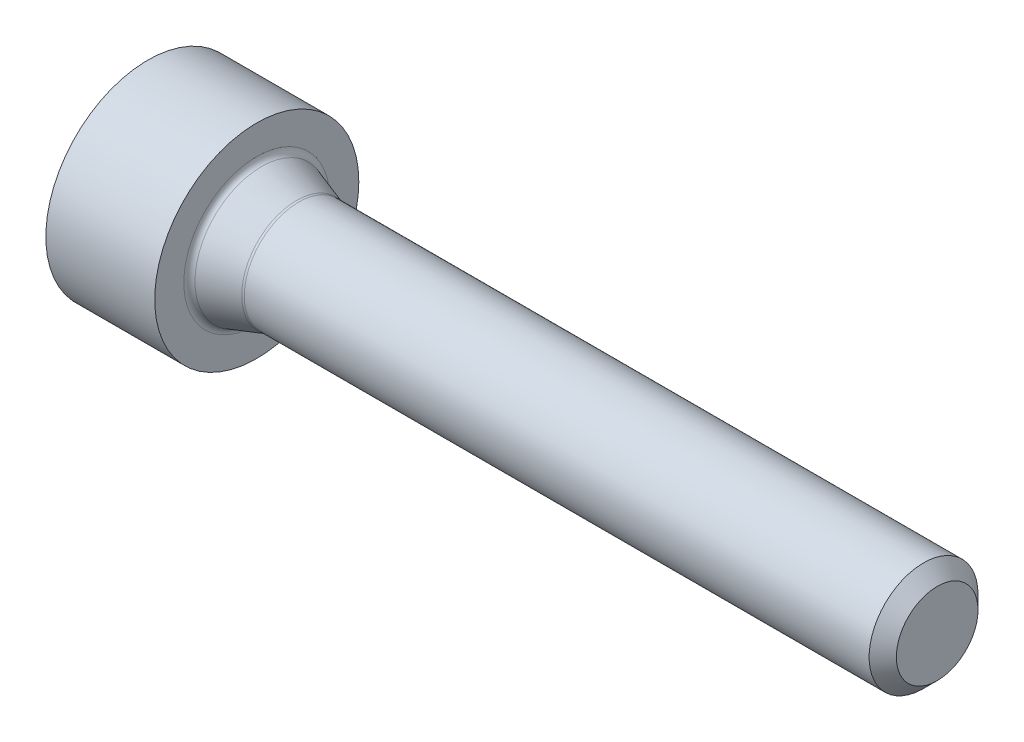
ISO-10303-21;
HEADER;
FILE_DESCRIPTION(('STEP AP214'),'2;1');
FILE_NAME('part.step','',(''),(''),'','','');
FILE_SCHEMA(('AUTOMOTIVE_DESIGN { 1 0 10303 214 1 1 1 1 }'));
ENDSEC;
DATA;
#1=APPLICATION_CONTEXT('core data for automotive mechanical design processes');
#2=APPLICATION_PROTOCOL_DEFINITION('international standard','automotive_design',2000,#1);
#3=PRODUCT_CONTEXT('',#1,'mechanical');
#4=PRODUCT('Part','Part','',(#3));
#5=PRODUCT_RELATED_PRODUCT_CATEGORY('part','',(#4));
#6=PRODUCT_DEFINITION_FORMATION('','',#4);
#7=PRODUCT_DEFINITION_CONTEXT('part definition',#1,'design');
#8=PRODUCT_DEFINITION('design','',#6,#7);
#9=PRODUCT_DEFINITION_SHAPE('','',#8);
#10=(LENGTH_UNIT() NAMED_UNIT(*) SI_UNIT(.MILLI.,.METRE.));
#11=(NAMED_UNIT(*) PLANE_ANGLE_UNIT() SI_UNIT($,.RADIAN.));
#12=(NAMED_UNIT(*) SI_UNIT($,.STERADIAN.) SOLID_ANGLE_UNIT());
#13=UNCERTAINTY_MEASURE_WITH_UNIT(LENGTH_MEASURE(1.E-05),#10,'distance_accuracy_value','');
#14=(GEOMETRIC_REPRESENTATION_CONTEXT(3) GLOBAL_UNCERTAINTY_ASSIGNED_CONTEXT((#13)) GLOBAL_UNIT_ASSIGNED_CONTEXT((#10,
#11,#12)) REPRESENTATION_CONTEXT('',''));
#15=CARTESIAN_POINT('',(0.,0.,0.));
#16=DIRECTION('',(0.,0.,1.));
#17=DIRECTION('',(1.,0.,0.));
#18=AXIS2_PLACEMENT_3D('',#15,#16,#17);
#19=CARTESIAN_POINT('',(0.,0.,0.));
#20=DIRECTION('',(-1.,0.,0.));
#21=DIRECTION('',(0.,0.,1.));
#22=AXIS2_PLACEMENT_3D('',#19,#20,#21);
#23=PLANE('',#22);
#24=DIRECTION('',(0.,0.5,-0.866025403784439));
#25=VECTOR('',#24,1.);
#26=CARTESIAN_POINT('',(0.,0.43325,0.750411012379216));
#27=LINE('',#26,#25);
#28=CARTESIAN_POINT('',(0.,0.43325,0.750411012379216));
#29=VERTEX_POINT('',#28);
#30=CARTESIAN_POINT('',(0.,0.8665,0.));
#31=VERTEX_POINT('',#30);
#32=EDGE_CURVE('E54',#29,#31,#27,.T.);
#33=ORIENTED_EDGE('',*,*,#32,.F.);
#34=DIRECTION('',(0.,1.,0.));
#35=VECTOR('',#34,1.);
#36=CARTESIAN_POINT('',(0.,-0.43325,0.750411012379216));
#37=LINE('',#36,#35);
#38=CARTESIAN_POINT('',(0.,-0.43325,0.750411012379216));
#39=VERTEX_POINT('',#38);
#40=EDGE_CURVE('E137',#39,#29,#37,.T.);
#41=ORIENTED_EDGE('',*,*,#40,.F.);
#42=DIRECTION('',(0.,0.5,0.866025403784439));
#43=VECTOR('',#42,1.);
#44=CARTESIAN_POINT('',(0.,-0.8665,0.));
#45=LINE('',#44,#43);
#46=CARTESIAN_POINT('',(0.,-0.8665,0.));
#47=VERTEX_POINT('',#46);
#48=EDGE_CURVE('E135',#47,#39,#45,.T.);
#49=ORIENTED_EDGE('',*,*,#48,.F.);
#50=DIRECTION('',(0.,-0.5,0.866025403784439));
#51=VECTOR('',#50,1.);
#52=CARTESIAN_POINT('',(0.,-0.43325,-0.750411012379216));
#53=LINE('',#52,#51);
#54=CARTESIAN_POINT('',(0.,-0.43325,-0.750411012379216));
#55=VERTEX_POINT('',#54);
#56=EDGE_CURVE('E102',#55,#47,#53,.T.);
#57=ORIENTED_EDGE('',*,*,#56,.F.);
#58=DIRECTION('',(0.,-1.,0.));
#59=VECTOR('',#58,1.);
#60=CARTESIAN_POINT('',(0.,0.43325,-0.750411012379216));
#61=LINE('',#60,#59);
#62=CARTESIAN_POINT('',(0.,0.43325,-0.750411012379216));
#63=VERTEX_POINT('',#62);
#64=EDGE_CURVE('E131',#63,#55,#61,.T.);
#65=ORIENTED_EDGE('',*,*,#64,.F.);
#66=DIRECTION('',(0.,-0.5,-0.866025403784439));
#67=VECTOR('',#66,1.);
#68=CARTESIAN_POINT('',(0.,0.8665,0.));
#69=LINE('',#68,#67);
#70=EDGE_CURVE('E128',#31,#63,#69,.T.);
#71=ORIENTED_EDGE('',*,*,#70,.F.);
#72=EDGE_LOOP('',(#33,#41,#49,#57,#65,#71));
#73=FACE_BOUND('',#72,.T.);
#74=CARTESIAN_POINT('',(0.,0.,0.));
#75=DIRECTION('',(1.,0.,0.));
#76=DIRECTION('',(0.,0.,-1.));
#77=AXIS2_PLACEMENT_3D('',#74,#75,#76);
#78=CIRCLE('',#77,1.5);
#79=CARTESIAN_POINT('',(0.,0.,-1.5));
#80=VERTEX_POINT('',#79);
#81=EDGE_CURVE('E149',#80,#80,#78,.T.);
#82=ORIENTED_EDGE('',*,*,#81,.F.);
#83=EDGE_LOOP('',(#82));
#84=FACE_BOUND('',#83,.T.);
#85=ADVANCED_FACE('F39',(#73,#84),#23,.T.);
#86=CARTESIAN_POINT('',(0.,0.,0.));
#87=DIRECTION('',(1.,0.,0.));
#88=DIRECTION('',(0.,0.,-1.));
#89=AXIS2_PLACEMENT_3D('',#86,#87,#88);
#90=CYLINDRICAL_SURFACE('',#89,1.5);
#91=ORIENTED_EDGE('',*,*,#81,.T.);
#92=EDGE_LOOP('',(#91));
#93=FACE_BOUND('',#92,.T.);
#94=CARTESIAN_POINT('',(1.6,0.,0.));
#95=DIRECTION('',(1.,0.,0.));
#96=DIRECTION('',(0.,0.,-1.));
#97=AXIS2_PLACEMENT_3D('',#94,#95,#96);
#98=CIRCLE('',#97,1.5);
#99=CARTESIAN_POINT('',(1.6,0.,-1.5));
#100=VERTEX_POINT('',#99);
#101=EDGE_CURVE('E141',#100,#100,#98,.T.);
#102=ORIENTED_EDGE('',*,*,#101,.F.);
#103=EDGE_LOOP('',(#102));
#104=FACE_BOUND('',#103,.T.);
#105=ADVANCED_FACE('F182',(#93,#104),#90,.T.);
#106=CARTESIAN_POINT('',(1.6,1.5,0.));
#107=DIRECTION('',(1.,0.,0.));
#108=DIRECTION('',(0.,0.,-1.));
#109=AXIS2_PLACEMENT_3D('',#106,#107,#108);
#110=PLANE('',#109);
#111=CARTESIAN_POINT('',(1.6,0.,0.));
#112=DIRECTION('',(1.,0.,0.));
#113=DIRECTION('',(0.,0.,-1.));
#114=AXIS2_PLACEMENT_3D('',#111,#112,#113);
#115=CIRCLE('',#114,1.07207592200561);
#116=CARTESIAN_POINT('',(1.6,0.,-1.07207592200561));
#117=VERTEX_POINT('',#116);
#118=EDGE_CURVE('E161',#117,#117,#115,.F.);
#119=ORIENTED_EDGE('',*,*,#118,.T.);
#120=EDGE_LOOP('',(#119));
#121=FACE_BOUND('',#120,.T.);
#122=ORIENTED_EDGE('',*,*,#101,.T.);
#123=EDGE_LOOP('',(#122));
#124=FACE_BOUND('',#123,.T.);
#125=ADVANCED_FACE('F188',(#121,#124),#110,.T.);
#126=CARTESIAN_POINT('',(2.2,0.,0.));
#127=DIRECTION('',(-1.,0.,0.));
#128=DIRECTION('',(0.,0.,1.));
#129=AXIS2_PLACEMENT_3D('',#126,#127,#128);
#130=CONICAL_SURFACE('',#129,0.800000000000001,0.32175055439664);
#131=CARTESIAN_POINT('',(2.18460498941515,0.,0.));
#132=DIRECTION('',(-1.,0.,0.));
#133=DIRECTION('',(0.,0.,1.));
#134=AXIS2_PLACEMENT_3D('',#131,#132,#133);
#135=CIRCLE('',#134,0.80513167019495);
#136=CARTESIAN_POINT('',(2.18460498941515,0.,0.80513167019495));
#137=VERTEX_POINT('',#136);
#138=EDGE_CURVE('E158',#137,#137,#135,.T.);
#139=ORIENTED_EDGE('',*,*,#138,.T.);
#140=EDGE_LOOP('',(#139));
#141=FACE_BOUND('',#140,.T.);
#142=CARTESIAN_POINT('',(1.66837722339832,0.,0.));
#143=DIRECTION('',(-1.,0.,0.));
#144=DIRECTION('',(0.,0.,1.));
#145=AXIS2_PLACEMENT_3D('',#142,#143,#144);
#146=CIRCLE('',#145,0.977207592200562);
#147=CARTESIAN_POINT('',(1.66837722339832,0.,0.977207592200562));
#148=VERTEX_POINT('',#147);
#149=EDGE_CURVE('E155',#148,#148,#146,.F.);
#150=ORIENTED_EDGE('',*,*,#149,.T.);
#151=EDGE_LOOP('',(#150));
#152=FACE_BOUND('',#151,.T.);
#153=ADVANCED_FACE('F206',(#141,#152),#130,.T.);
#154=CARTESIAN_POINT('',(0.,0.,0.));
#155=DIRECTION('',(1.,0.,0.));
#156=DIRECTION('',(0.,0.,-1.));
#157=AXIS2_PLACEMENT_3D('',#154,#155,#156);
#158=CYLINDRICAL_SURFACE('',#157,0.800000000000001);
#159=CARTESIAN_POINT('',(11.4,0.,0.));
#160=DIRECTION('',(1.,0.,0.));
#161=DIRECTION('',(0.,0.,-1.));
#162=AXIS2_PLACEMENT_3D('',#159,#160,#161);
#163=CIRCLE('',#162,0.800000000000001);
#164=CARTESIAN_POINT('',(11.4,0.,-0.800000000000001));
#165=VERTEX_POINT('',#164);
#166=EDGE_CURVE('E11',#165,#165,#163,.F.);
#167=ORIENTED_EDGE('',*,*,#166,.T.);
#168=EDGE_LOOP('',(#167));
#169=FACE_BOUND('',#168,.T.);
#170=CARTESIAN_POINT('',(2.21622776601684,0.,0.));
#171=DIRECTION('',(1.,0.,0.));
#172=DIRECTION('',(0.,0.,-1.));
#173=AXIS2_PLACEMENT_3D('',#170,#171,#172);
#174=CIRCLE('',#173,0.800000000000001);
#175=CARTESIAN_POINT('',(2.21622776601684,0.,-0.800000000000001));
#176=VERTEX_POINT('',#175);
#177=EDGE_CURVE('E152',#176,#176,#174,.T.);
#178=ORIENTED_EDGE('',*,*,#177,.T.);
#179=EDGE_LOOP('',(#178));
#180=FACE_BOUND('',#179,.T.);
#181=ADVANCED_FACE('F199',(#169,#180),#158,.T.);
#182=CARTESIAN_POINT('',(11.6,0.800000000000001,0.));
#183=DIRECTION('',(1.,0.,0.));
#184=DIRECTION('',(0.,0.,-1.));
#185=AXIS2_PLACEMENT_3D('',#182,#183,#184);
#186=PLANE('',#185);
#187=CARTESIAN_POINT('',(11.6,0.,0.));
#188=DIRECTION('',(1.,0.,0.));
#189=DIRECTION('',(0.,0.,-1.));
#190=AXIS2_PLACEMENT_3D('',#187,#188,#189);
#191=CIRCLE('',#190,0.6);
#192=CARTESIAN_POINT('',(11.6,0.,-0.6));
#193=VERTEX_POINT('',#192);
#194=EDGE_CURVE('E47',#193,#193,#191,.T.);
#195=ORIENTED_EDGE('',*,*,#194,.T.);
#196=EDGE_LOOP('',(#195));
#197=FACE_BOUND('',#196,.T.);
#198=ADVANCED_FACE('F166',(#197),#186,.T.);
#199=CARTESIAN_POINT('',(2.21622776601684,0.,0.));
#200=DIRECTION('',(1.,0.,0.));
#201=DIRECTION('',(0.,0.,-1.));
#202=AXIS2_PLACEMENT_3D('',#199,#200,#201);
#203=TOROIDAL_SURFACE('',#202,0.900000000000001,0.1);
#204=ORIENTED_EDGE('',*,*,#138,.F.);
#205=EDGE_LOOP('',(#204));
#206=FACE_BOUND('',#205,.T.);
#207=ORIENTED_EDGE('',*,*,#177,.F.);
#208=EDGE_LOOP('',(#207));
#209=FACE_BOUND('',#208,.T.);
#210=ADVANCED_FACE('F178',(#206,#209),#203,.F.);
#211=CARTESIAN_POINT('',(1.7,0.,0.));
#212=DIRECTION('',(1.,0.,0.));
#213=DIRECTION('',(0.,0.,-1.));
#214=AXIS2_PLACEMENT_3D('',#211,#212,#213);
#215=TOROIDAL_SURFACE('',#214,1.07207592200561,0.1);
#216=ORIENTED_EDGE('',*,*,#118,.F.);
#217=EDGE_LOOP('',(#216));
#218=FACE_BOUND('',#217,.T.);
#219=ORIENTED_EDGE('',*,*,#149,.F.);
#220=EDGE_LOOP('',(#219));
#221=FACE_BOUND('',#220,.T.);
#222=ADVANCED_FACE('F170',(#218,#221),#215,.F.);
#223=CARTESIAN_POINT('',(11.6,0.,0.));
#224=DIRECTION('',(-1.,0.,0.));
#225=DIRECTION('',(0.,0.,1.));
#226=AXIS2_PLACEMENT_3D('',#223,#224,#225);
#227=CONICAL_SURFACE('',#226,0.6,0.785398163397447);
#228=ORIENTED_EDGE('',*,*,#166,.F.);
#229=EDGE_LOOP('',(#228));
#230=FACE_BOUND('',#229,.T.);
#231=ORIENTED_EDGE('',*,*,#194,.F.);
#232=EDGE_LOOP('',(#231));
#233=FACE_BOUND('',#232,.T.);
#234=ADVANCED_FACE('F41',(#230,#233),#227,.T.);
#235=CARTESIAN_POINT('',(0.7,0.43325,0.750411012379216));
#236=DIRECTION('',(0.,0.866025403784439,0.5));
#237=DIRECTION('',(0.,-0.5,0.866025403784439));
#238=AXIS2_PLACEMENT_3D('',#235,#236,#237);
#239=PLANE('',#238);
#240=ORIENTED_EDGE('',*,*,#32,.T.);
#241=DIRECTION('',(-1.,0.,0.));
#242=VECTOR('',#241,1.);
#243=CARTESIAN_POINT('',(0.7,0.8665,0.));
#244=LINE('',#243,#242);
#245=CARTESIAN_POINT('',(0.7,0.8665,0.));
#246=VERTEX_POINT('',#245);
#247=EDGE_CURVE('E84',#246,#31,#244,.T.);
#248=ORIENTED_EDGE('',*,*,#247,.F.);
#249=DIRECTION('',(0.,0.5,-0.866025403784439));
#250=VECTOR('',#249,1.);
#251=CARTESIAN_POINT('',(0.7,0.43325,0.750411012379216));
#252=LINE('',#251,#250);
#253=CARTESIAN_POINT('',(0.7,0.43325,0.750411012379216));
#254=VERTEX_POINT('',#253);
#255=EDGE_CURVE('E139',#254,#246,#252,.T.);
#256=ORIENTED_EDGE('',*,*,#255,.F.);
#257=DIRECTION('',(-1.,0.,0.));
#258=VECTOR('',#257,1.);
#259=CARTESIAN_POINT('',(0.7,0.43325,0.750411012379216));
#260=LINE('',#259,#258);
#261=EDGE_CURVE('E62',#254,#29,#260,.T.);
#262=ORIENTED_EDGE('',*,*,#261,.T.);
#263=EDGE_LOOP('',(#240,#248,#256,#262));
#264=FACE_BOUND('',#263,.T.);
#265=ADVANCED_FACE('F169',(#264),#239,.F.);
#266=CARTESIAN_POINT('',(0.7,-0.43325,0.750411012379216));
#267=DIRECTION('',(0.,0.,1.));
#268=DIRECTION('',(0.,-1.,0.));
#269=AXIS2_PLACEMENT_3D('',#266,#267,#268);
#270=PLANE('',#269);
#271=ORIENTED_EDGE('',*,*,#40,.T.);
#272=ORIENTED_EDGE('',*,*,#261,.F.);
#273=DIRECTION('',(0.,1.,0.));
#274=VECTOR('',#273,1.);
#275=CARTESIAN_POINT('',(0.7,-0.43325,0.750411012379216));
#276=LINE('',#275,#274);
#277=CARTESIAN_POINT('',(0.7,-0.43325,0.750411012379216));
#278=VERTEX_POINT('',#277);
#279=EDGE_CURVE('E114',#278,#254,#276,.T.);
#280=ORIENTED_EDGE('',*,*,#279,.F.);
#281=DIRECTION('',(-1.,0.,0.));
#282=VECTOR('',#281,1.);
#283=CARTESIAN_POINT('',(0.7,-0.43325,0.750411012379216));
#284=LINE('',#283,#282);
#285=EDGE_CURVE('E106',#278,#39,#284,.T.);
#286=ORIENTED_EDGE('',*,*,#285,.T.);
#287=EDGE_LOOP('',(#271,#272,#280,#286));
#288=FACE_BOUND('',#287,.T.);
#289=ADVANCED_FACE('F176',(#288),#270,.F.);
#290=CARTESIAN_POINT('',(0.7,-0.8665,0.));
#291=DIRECTION('',(0.,-0.866025403784439,0.5));
#292=DIRECTION('',(0.,-0.5,-0.866025403784439));
#293=AXIS2_PLACEMENT_3D('',#290,#291,#292);
#294=PLANE('',#293);
#295=ORIENTED_EDGE('',*,*,#48,.T.);
#296=ORIENTED_EDGE('',*,*,#285,.F.);
#297=DIRECTION('',(0.,0.5,0.866025403784439));
#298=VECTOR('',#297,1.);
#299=CARTESIAN_POINT('',(0.7,-0.8665,0.));
#300=LINE('',#299,#298);
#301=CARTESIAN_POINT('',(0.7,-0.8665,0.));
#302=VERTEX_POINT('',#301);
#303=EDGE_CURVE('E110',#302,#278,#300,.T.);
#304=ORIENTED_EDGE('',*,*,#303,.F.);
#305=DIRECTION('',(-1.,0.,0.));
#306=VECTOR('',#305,1.);
#307=CARTESIAN_POINT('',(0.7,-0.8665,0.));
#308=LINE('',#307,#306);
#309=EDGE_CURVE('E95',#302,#47,#308,.T.);
#310=ORIENTED_EDGE('',*,*,#309,.T.);
#311=EDGE_LOOP('',(#295,#296,#304,#310));
#312=FACE_BOUND('',#311,.T.);
#313=ADVANCED_FACE('F111',(#312),#294,.F.);
#314=CARTESIAN_POINT('',(0.7,-0.43325,-0.750411012379216));
#315=DIRECTION('',(0.,-0.866025403784439,-0.5));
#316=DIRECTION('',(0.,0.5,-0.866025403784439));
#317=AXIS2_PLACEMENT_3D('',#314,#315,#316);
#318=PLANE('',#317);
#319=ORIENTED_EDGE('',*,*,#56,.T.);
#320=ORIENTED_EDGE('',*,*,#309,.F.);
#321=DIRECTION('',(0.,-0.5,0.866025403784439));
#322=VECTOR('',#321,1.);
#323=CARTESIAN_POINT('',(0.7,-0.43325,-0.750411012379216));
#324=LINE('',#323,#322);
#325=CARTESIAN_POINT('',(0.7,-0.43325,-0.750411012379216));
#326=VERTEX_POINT('',#325);
#327=EDGE_CURVE('E99',#326,#302,#324,.T.);
#328=ORIENTED_EDGE('',*,*,#327,.F.);
#329=DIRECTION('',(-1.,0.,0.));
#330=VECTOR('',#329,1.);
#331=CARTESIAN_POINT('',(0.7,-0.43325,-0.750411012379216));
#332=LINE('',#331,#330);
#333=EDGE_CURVE('E107',#326,#55,#332,.T.);
#334=ORIENTED_EDGE('',*,*,#333,.T.);
#335=EDGE_LOOP('',(#319,#320,#328,#334));
#336=FACE_BOUND('',#335,.T.);
#337=ADVANCED_FACE('F97',(#336),#318,.F.);
#338=CARTESIAN_POINT('',(0.7,0.43325,-0.750411012379216));
#339=DIRECTION('',(0.,0.,-1.));
#340=DIRECTION('',(0.,1.,0.));
#341=AXIS2_PLACEMENT_3D('',#338,#339,#340);
#342=PLANE('',#341);
#343=ORIENTED_EDGE('',*,*,#64,.T.);
#344=ORIENTED_EDGE('',*,*,#333,.F.);
#345=DIRECTION('',(0.,-1.,0.));
#346=VECTOR('',#345,1.);
#347=CARTESIAN_POINT('',(0.7,0.43325,-0.750411012379216));
#348=LINE('',#347,#346);
#349=CARTESIAN_POINT('',(0.7,0.43325,-0.750411012379216));
#350=VERTEX_POINT('',#349);
#351=EDGE_CURVE('E120',#350,#326,#348,.T.);
#352=ORIENTED_EDGE('',*,*,#351,.F.);
#353=DIRECTION('',(-1.,0.,0.));
#354=VECTOR('',#353,1.);
#355=CARTESIAN_POINT('',(0.7,0.43325,-0.750411012379216));
#356=LINE('',#355,#354);
#357=EDGE_CURVE('E144',#350,#63,#356,.T.);
#358=ORIENTED_EDGE('',*,*,#357,.T.);
#359=EDGE_LOOP('',(#343,#344,#352,#358));
#360=FACE_BOUND('',#359,.T.);
#361=ADVANCED_FACE('F291',(#360),#342,.F.);
#362=CARTESIAN_POINT('',(0.7,0.8665,0.));
#363=DIRECTION('',(0.,0.866025403784439,-0.5));
#364=DIRECTION('',(0.,0.5,0.866025403784439));
#365=AXIS2_PLACEMENT_3D('',#362,#363,#364);
#366=PLANE('',#365);
#367=ORIENTED_EDGE('',*,*,#70,.T.);
#368=ORIENTED_EDGE('',*,*,#357,.F.);
#369=DIRECTION('',(0.,-0.5,-0.866025403784439));
#370=VECTOR('',#369,1.);
#371=CARTESIAN_POINT('',(0.7,0.8665,0.));
#372=LINE('',#371,#370);
#373=EDGE_CURVE('E122',#246,#350,#372,.T.);
#374=ORIENTED_EDGE('',*,*,#373,.F.);
#375=ORIENTED_EDGE('',*,*,#247,.T.);
#376=EDGE_LOOP('',(#367,#368,#374,#375));
#377=FACE_BOUND('',#376,.T.);
#378=ADVANCED_FACE('F300',(#377),#366,.F.);
#379=CARTESIAN_POINT('',(0.7,0.,0.));
#380=DIRECTION('',(-1.,0.,0.));
#381=DIRECTION('',(0.,0.,1.));
#382=AXIS2_PLACEMENT_3D('',#379,#380,#381);
#383=PLANE('',#382);
#384=ORIENTED_EDGE('',*,*,#255,.T.);
#385=ORIENTED_EDGE('',*,*,#373,.T.);
#386=ORIENTED_EDGE('',*,*,#351,.T.);
#387=ORIENTED_EDGE('',*,*,#327,.T.);
#388=ORIENTED_EDGE('',*,*,#303,.T.);
#389=ORIENTED_EDGE('',*,*,#279,.T.);
#390=EDGE_LOOP('',(#384,#385,#386,#387,#388,#389));
#391=FACE_BOUND('',#390,.T.);
#392=ADVANCED_FACE('F117',(#391),#383,.T.);
#393=CLOSED_SHELL('',(#85,#105,#125,#153,#181,#198,#210,#222,#234,#265,#289,#313,#337,#361,#378,#392));
#394=MANIFOLD_SOLID_BREP('B2',#393);
#395=ADVANCED_BREP_SHAPE_REPRESENTATION('',(#18,#394),#14);
#396=SHAPE_DEFINITION_REPRESENTATION(#9,#395);
ENDSEC;
END-ISO-10303-21;
